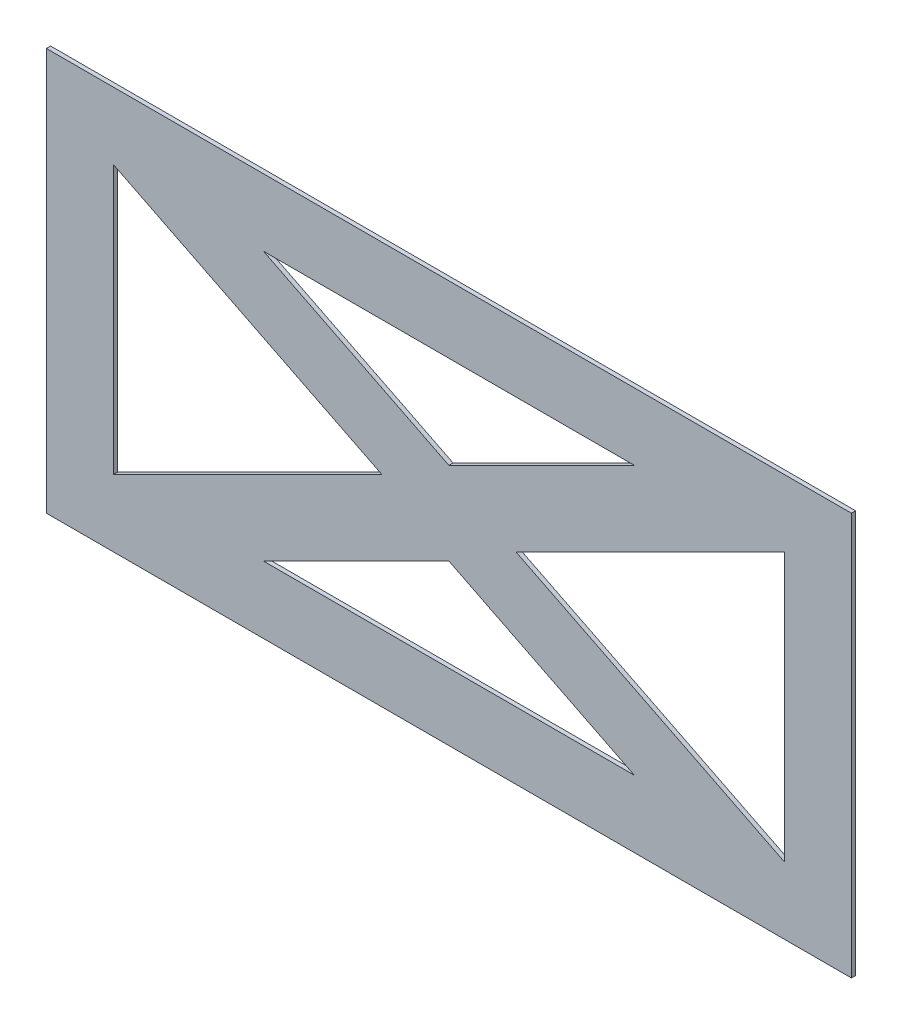
ISO-10303-21;
HEADER;
FILE_DESCRIPTION(('STEP AP214'),'2;1');
FILE_NAME('part.step','',(''),(''),'','','');
FILE_SCHEMA(('AUTOMOTIVE_DESIGN { 1 0 10303 214 1 1 1 1 }'));
ENDSEC;
DATA;
#1=APPLICATION_CONTEXT('core data for automotive mechanical design processes');
#2=APPLICATION_PROTOCOL_DEFINITION('international standard','automotive_design',2000,#1);
#3=PRODUCT_CONTEXT('',#1,'mechanical');
#4=PRODUCT('Part','Part','',(#3));
#5=PRODUCT_RELATED_PRODUCT_CATEGORY('part','',(#4));
#6=PRODUCT_DEFINITION_FORMATION('','',#4);
#7=PRODUCT_DEFINITION_CONTEXT('part definition',#1,'design');
#8=PRODUCT_DEFINITION('design','',#6,#7);
#9=PRODUCT_DEFINITION_SHAPE('','',#8);
#10=(LENGTH_UNIT() NAMED_UNIT(*) SI_UNIT(.MILLI.,.METRE.));
#11=(NAMED_UNIT(*) PLANE_ANGLE_UNIT() SI_UNIT($,.RADIAN.));
#12=(NAMED_UNIT(*) SI_UNIT($,.STERADIAN.) SOLID_ANGLE_UNIT());
#13=UNCERTAINTY_MEASURE_WITH_UNIT(LENGTH_MEASURE(1.E-05),#10,'distance_accuracy_value','');
#14=(GEOMETRIC_REPRESENTATION_CONTEXT(3) GLOBAL_UNCERTAINTY_ASSIGNED_CONTEXT((#13)) GLOBAL_UNIT_ASSIGNED_CONTEXT((#10,
#11,#12)) REPRESENTATION_CONTEXT('',''));
#15=CARTESIAN_POINT('',(0.,0.,0.));
#16=DIRECTION('',(0.,0.,1.));
#17=DIRECTION('',(1.,0.,0.));
#18=AXIS2_PLACEMENT_3D('',#15,#16,#17);
#19=CARTESIAN_POINT('',(0.,0.,0.79375));
#20=DIRECTION('',(0.,0.,-1.));
#21=DIRECTION('',(-1.,0.,0.));
#22=AXIS2_PLACEMENT_3D('',#19,#20,#21);
#23=PLANE('',#22);
#24=DIRECTION('',(-0.894427190999916,0.447213595499958,0.));
#25=VECTOR('',#24,1.);
#26=CARTESIAN_POINT('',(70.2038733715053,-50.8,0.79375));
#27=LINE('',#26,#25);
#28=CARTESIAN_POINT('',(70.2038733715053,-50.8,0.79375));
#29=VERTEX_POINT('',#28);
#30=CARTESIAN_POINT('',(0.,-15.6980633142473,0.79375));
#31=VERTEX_POINT('',#30);
#32=EDGE_CURVE('E183',#29,#31,#27,.T.);
#33=ORIENTED_EDGE('',*,*,#32,.F.);
#34=DIRECTION('',(1.,0.,0.));
#35=VECTOR('',#34,1.);
#36=CARTESIAN_POINT('',(-70.2038733715053,-50.8,0.79375));
#37=LINE('',#36,#35);
#38=CARTESIAN_POINT('',(-70.2038733715053,-50.8,0.79375));
#39=VERTEX_POINT('',#38);
#40=EDGE_CURVE('E189',#39,#29,#37,.T.);
#41=ORIENTED_EDGE('',*,*,#40,.F.);
#42=DIRECTION('',(-0.894427190999916,-0.447213595499958,0.));
#43=VECTOR('',#42,1.);
#44=CARTESIAN_POINT('',(0.,-15.6980633142473,0.79375));
#45=LINE('',#44,#43);
#46=EDGE_CURVE('E185',#31,#39,#45,.T.);
#47=ORIENTED_EDGE('',*,*,#46,.F.);
#48=EDGE_LOOP('',(#33,#41,#47));
#49=FACE_BOUND('',#48,.T.);
#50=DIRECTION('',(-0.894427190999916,0.447213595499958,0.));
#51=VECTOR('',#50,1.);
#52=CARTESIAN_POINT('',(-25.4,0.,0.79375));
#53=LINE('',#52,#51);
#54=CARTESIAN_POINT('',(-25.4,0.,0.79375));
#55=VERTEX_POINT('',#54);
#56=CARTESIAN_POINT('',(-127.,50.8,0.79375));
#57=VERTEX_POINT('',#56);
#58=EDGE_CURVE('E231',#55,#57,#53,.T.);
#59=ORIENTED_EDGE('',*,*,#58,.F.);
#60=DIRECTION('',(0.894427190999916,0.447213595499958,0.));
#61=VECTOR('',#60,1.);
#62=CARTESIAN_POINT('',(-127.,-50.8,0.79375));
#63=LINE('',#62,#61);
#64=CARTESIAN_POINT('',(-127.,-50.8,0.79375));
#65=VERTEX_POINT('',#64);
#66=EDGE_CURVE('E237',#65,#55,#63,.T.);
#67=ORIENTED_EDGE('',*,*,#66,.F.);
#68=DIRECTION('',(0.,-1.,0.));
#69=VECTOR('',#68,1.);
#70=CARTESIAN_POINT('',(-127.,50.8,0.79375));
#71=LINE('',#70,#69);
#72=EDGE_CURVE('E233',#57,#65,#71,.T.);
#73=ORIENTED_EDGE('',*,*,#72,.F.);
#74=EDGE_LOOP('',(#59,#67,#73));
#75=FACE_BOUND('',#74,.T.);
#76=DIRECTION('',(0.,1.,0.));
#77=VECTOR('',#76,1.);
#78=CARTESIAN_POINT('',(152.4,-76.2,0.79375));
#79=LINE('',#78,#77);
#80=CARTESIAN_POINT('',(152.4,-76.2,0.79375));
#81=VERTEX_POINT('',#80);
#82=CARTESIAN_POINT('',(152.4,76.2,0.79375));
#83=VERTEX_POINT('',#82);
#84=EDGE_CURVE('E255',#81,#83,#79,.T.);
#85=ORIENTED_EDGE('',*,*,#84,.T.);
#86=DIRECTION('',(-1.,0.,0.));
#87=VECTOR('',#86,1.);
#88=CARTESIAN_POINT('',(-152.4,76.2,0.79375));
#89=LINE('',#88,#87);
#90=CARTESIAN_POINT('',(-152.4,76.2,0.79375));
#91=VERTEX_POINT('',#90);
#92=EDGE_CURVE('E258',#83,#91,#89,.T.);
#93=ORIENTED_EDGE('',*,*,#92,.T.);
#94=DIRECTION('',(0.,-1.,0.));
#95=VECTOR('',#94,1.);
#96=CARTESIAN_POINT('',(-152.4,-76.2,0.79375));
#97=LINE('',#96,#95);
#98=CARTESIAN_POINT('',(-152.4,-76.2,0.79375));
#99=VERTEX_POINT('',#98);
#100=EDGE_CURVE('E261',#91,#99,#97,.T.);
#101=ORIENTED_EDGE('',*,*,#100,.T.);
#102=DIRECTION('',(1.,0.,0.));
#103=VECTOR('',#102,1.);
#104=CARTESIAN_POINT('',(-152.4,-76.2,0.79375));
#105=LINE('',#104,#103);
#106=EDGE_CURVE('E263',#99,#81,#105,.T.);
#107=ORIENTED_EDGE('',*,*,#106,.T.);
#108=EDGE_LOOP('',(#85,#93,#101,#107));
#109=FACE_BOUND('',#108,.T.);
#110=DIRECTION('',(0.894427190999916,-0.447213595499958,0.));
#111=VECTOR('',#110,1.);
#112=CARTESIAN_POINT('',(0.,15.6980633142473,0.79375));
#113=LINE('',#112,#111);
#114=CARTESIAN_POINT('',(-70.2038733715054,50.8,0.79375));
#115=VERTEX_POINT('',#114);
#116=CARTESIAN_POINT('',(0.,15.6980633142473,0.79375));
#117=VERTEX_POINT('',#116);
#118=EDGE_CURVE('E207',#115,#117,#113,.T.);
#119=ORIENTED_EDGE('',*,*,#118,.F.);
#120=DIRECTION('',(-1.,0.,0.));
#121=VECTOR('',#120,1.);
#122=CARTESIAN_POINT('',(-70.2038733715054,50.8,0.79375));
#123=LINE('',#122,#121);
#124=CARTESIAN_POINT('',(70.2038733715054,50.8,0.79375));
#125=VERTEX_POINT('',#124);
#126=EDGE_CURVE('E213',#125,#115,#123,.T.);
#127=ORIENTED_EDGE('',*,*,#126,.F.);
#128=DIRECTION('',(0.894427190999916,0.447213595499958,0.));
#129=VECTOR('',#128,1.);
#130=CARTESIAN_POINT('',(70.2038733715054,50.8,0.79375));
#131=LINE('',#130,#129);
#132=EDGE_CURVE('E209',#117,#125,#131,.T.);
#133=ORIENTED_EDGE('',*,*,#132,.F.);
#134=EDGE_LOOP('',(#119,#127,#133));
#135=FACE_BOUND('',#134,.T.);
#136=DIRECTION('',(0.894427190999916,-0.447213595499958,0.));
#137=VECTOR('',#136,1.);
#138=CARTESIAN_POINT('',(127.,-50.8,0.79375));
#139=LINE('',#138,#137);
#140=CARTESIAN_POINT('',(25.4,0.,0.79375));
#141=VERTEX_POINT('',#140);
#142=CARTESIAN_POINT('',(127.,-50.8,0.79375));
#143=VERTEX_POINT('',#142);
#144=EDGE_CURVE('E156',#141,#143,#139,.T.);
#145=ORIENTED_EDGE('',*,*,#144,.F.);
#146=DIRECTION('',(-0.894427190999916,-0.447213595499958,0.));
#147=VECTOR('',#146,1.);
#148=CARTESIAN_POINT('',(25.4,0.,0.79375));
#149=LINE('',#148,#147);
#150=CARTESIAN_POINT('',(127.,50.8,0.79375));
#151=VERTEX_POINT('',#150);
#152=EDGE_CURVE('E173',#151,#141,#149,.T.);
#153=ORIENTED_EDGE('',*,*,#152,.F.);
#154=DIRECTION('',(0.,1.,0.));
#155=VECTOR('',#154,1.);
#156=CARTESIAN_POINT('',(127.,50.8,0.79375));
#157=LINE('',#156,#155);
#158=EDGE_CURVE('E164',#143,#151,#157,.T.);
#159=ORIENTED_EDGE('',*,*,#158,.F.);
#160=EDGE_LOOP('',(#145,#153,#159));
#161=FACE_BOUND('',#160,.T.);
#162=ADVANCED_FACE('F43',(#49,#75,#109,#135,#161),#23,.F.);
#163=CARTESIAN_POINT('',(0.,0.,-0.79375));
#164=DIRECTION('',(0.,0.,-1.));
#165=DIRECTION('',(-1.,0.,0.));
#166=AXIS2_PLACEMENT_3D('',#163,#164,#165);
#167=PLANE('',#166);
#168=DIRECTION('',(0.,1.,0.));
#169=VECTOR('',#168,1.);
#170=CARTESIAN_POINT('',(152.4,-76.2,-0.79375));
#171=LINE('',#170,#169);
#172=CARTESIAN_POINT('',(152.4,-76.2,-0.79375));
#173=VERTEX_POINT('',#172);
#174=CARTESIAN_POINT('',(152.4,76.2,-0.79375));
#175=VERTEX_POINT('',#174);
#176=EDGE_CURVE('E254',#173,#175,#171,.T.);
#177=ORIENTED_EDGE('',*,*,#176,.F.);
#178=DIRECTION('',(1.,0.,0.));
#179=VECTOR('',#178,1.);
#180=CARTESIAN_POINT('',(-152.4,-76.2,-0.79375));
#181=LINE('',#180,#179);
#182=CARTESIAN_POINT('',(-152.4,-76.2,-0.79375));
#183=VERTEX_POINT('',#182);
#184=EDGE_CURVE('E259',#183,#173,#181,.T.);
#185=ORIENTED_EDGE('',*,*,#184,.F.);
#186=DIRECTION('',(0.,-1.,0.));
#187=VECTOR('',#186,1.);
#188=CARTESIAN_POINT('',(-152.4,-76.2,-0.79375));
#189=LINE('',#188,#187);
#190=CARTESIAN_POINT('',(-152.4,76.2,-0.79375));
#191=VERTEX_POINT('',#190);
#192=EDGE_CURVE('E270',#191,#183,#189,.T.);
#193=ORIENTED_EDGE('',*,*,#192,.F.);
#194=DIRECTION('',(-1.,0.,0.));
#195=VECTOR('',#194,1.);
#196=CARTESIAN_POINT('',(-152.4,76.2,-0.79375));
#197=LINE('',#196,#195);
#198=EDGE_CURVE('E268',#175,#191,#197,.T.);
#199=ORIENTED_EDGE('',*,*,#198,.F.);
#200=EDGE_LOOP('',(#177,#185,#193,#199));
#201=FACE_BOUND('',#200,.T.);
#202=DIRECTION('',(0.894427190999916,0.447213595499958,0.));
#203=VECTOR('',#202,1.);
#204=CARTESIAN_POINT('',(-127.,-50.8,-0.79375));
#205=LINE('',#204,#203);
#206=CARTESIAN_POINT('',(-127.,-50.8,-0.79375));
#207=VERTEX_POINT('',#206);
#208=CARTESIAN_POINT('',(-25.4,0.,-0.79375));
#209=VERTEX_POINT('',#208);
#210=EDGE_CURVE('E234',#207,#209,#205,.T.);
#211=ORIENTED_EDGE('',*,*,#210,.T.);
#212=DIRECTION('',(-0.894427190999916,0.447213595499958,0.));
#213=VECTOR('',#212,1.);
#214=CARTESIAN_POINT('',(-25.4,0.,-0.79375));
#215=LINE('',#214,#213);
#216=CARTESIAN_POINT('',(-127.,50.8,-0.79375));
#217=VERTEX_POINT('',#216);
#218=EDGE_CURVE('E230',#209,#217,#215,.T.);
#219=ORIENTED_EDGE('',*,*,#218,.T.);
#220=DIRECTION('',(0.,-1.,0.));
#221=VECTOR('',#220,1.);
#222=CARTESIAN_POINT('',(-127.,50.8,-0.79375));
#223=LINE('',#222,#221);
#224=EDGE_CURVE('E242',#217,#207,#223,.T.);
#225=ORIENTED_EDGE('',*,*,#224,.T.);
#226=EDGE_LOOP('',(#211,#219,#225));
#227=FACE_BOUND('',#226,.T.);
#228=DIRECTION('',(-1.,0.,0.));
#229=VECTOR('',#228,1.);
#230=CARTESIAN_POINT('',(-70.2038733715054,50.8,-0.79375));
#231=LINE('',#230,#229);
#232=CARTESIAN_POINT('',(70.2038733715054,50.8,-0.79375));
#233=VERTEX_POINT('',#232);
#234=CARTESIAN_POINT('',(-70.2038733715054,50.8,-0.79375));
#235=VERTEX_POINT('',#234);
#236=EDGE_CURVE('E210',#233,#235,#231,.T.);
#237=ORIENTED_EDGE('',*,*,#236,.T.);
#238=DIRECTION('',(0.894427190999916,-0.447213595499958,0.));
#239=VECTOR('',#238,1.);
#240=CARTESIAN_POINT('',(0.,15.6980633142473,-0.79375));
#241=LINE('',#240,#239);
#242=CARTESIAN_POINT('',(0.,15.6980633142473,-0.79375));
#243=VERTEX_POINT('',#242);
#244=EDGE_CURVE('E206',#235,#243,#241,.T.);
#245=ORIENTED_EDGE('',*,*,#244,.T.);
#246=DIRECTION('',(0.894427190999916,0.447213595499958,0.));
#247=VECTOR('',#246,1.);
#248=CARTESIAN_POINT('',(70.2038733715054,50.8,-0.79375));
#249=LINE('',#248,#247);
#250=EDGE_CURVE('E218',#243,#233,#249,.T.);
#251=ORIENTED_EDGE('',*,*,#250,.T.);
#252=EDGE_LOOP('',(#237,#245,#251));
#253=FACE_BOUND('',#252,.T.);
#254=DIRECTION('',(1.,0.,0.));
#255=VECTOR('',#254,1.);
#256=CARTESIAN_POINT('',(-70.2038733715053,-50.8,-0.79375));
#257=LINE('',#256,#255);
#258=CARTESIAN_POINT('',(-70.2038733715053,-50.8,-0.79375));
#259=VERTEX_POINT('',#258);
#260=CARTESIAN_POINT('',(70.2038733715053,-50.8,-0.79375));
#261=VERTEX_POINT('',#260);
#262=EDGE_CURVE('E186',#259,#261,#257,.T.);
#263=ORIENTED_EDGE('',*,*,#262,.T.);
#264=DIRECTION('',(-0.894427190999916,0.447213595499958,0.));
#265=VECTOR('',#264,1.);
#266=CARTESIAN_POINT('',(70.2038733715053,-50.8,-0.79375));
#267=LINE('',#266,#265);
#268=CARTESIAN_POINT('',(0.,-15.6980633142473,-0.79375));
#269=VERTEX_POINT('',#268);
#270=EDGE_CURVE('E171',#261,#269,#267,.T.);
#271=ORIENTED_EDGE('',*,*,#270,.T.);
#272=DIRECTION('',(-0.894427190999916,-0.447213595499958,0.));
#273=VECTOR('',#272,1.);
#274=CARTESIAN_POINT('',(0.,-15.6980633142473,-0.79375));
#275=LINE('',#274,#273);
#276=EDGE_CURVE('E194',#269,#259,#275,.T.);
#277=ORIENTED_EDGE('',*,*,#276,.T.);
#278=EDGE_LOOP('',(#263,#271,#277));
#279=FACE_BOUND('',#278,.T.);
#280=DIRECTION('',(-0.894427190999916,-0.447213595499958,0.));
#281=VECTOR('',#280,1.);
#282=CARTESIAN_POINT('',(25.4,0.,-0.79375));
#283=LINE('',#282,#281);
#284=CARTESIAN_POINT('',(127.,50.8,-0.79375));
#285=VERTEX_POINT('',#284);
#286=CARTESIAN_POINT('',(25.4,0.,-0.79375));
#287=VERTEX_POINT('',#286);
#288=EDGE_CURVE('E165',#285,#287,#283,.T.);
#289=ORIENTED_EDGE('',*,*,#288,.T.);
#290=DIRECTION('',(0.894427190999916,-0.447213595499958,0.));
#291=VECTOR('',#290,1.);
#292=CARTESIAN_POINT('',(127.,-50.8,-0.79375));
#293=LINE('',#292,#291);
#294=CARTESIAN_POINT('',(127.,-50.8,-0.79375));
#295=VERTEX_POINT('',#294);
#296=EDGE_CURVE('E66',#287,#295,#293,.T.);
#297=ORIENTED_EDGE('',*,*,#296,.T.);
#298=DIRECTION('',(0.,1.,0.));
#299=VECTOR('',#298,1.);
#300=CARTESIAN_POINT('',(127.,50.8,-0.79375));
#301=LINE('',#300,#299);
#302=EDGE_CURVE('E170',#295,#285,#301,.T.);
#303=ORIENTED_EDGE('',*,*,#302,.T.);
#304=EDGE_LOOP('',(#289,#297,#303));
#305=FACE_BOUND('',#304,.T.);
#306=ADVANCED_FACE('F288',(#201,#227,#253,#279,#305),#167,.T.);
#307=CARTESIAN_POINT('',(152.4,-76.2,0.79375));
#308=DIRECTION('',(-1.,0.,0.));
#309=DIRECTION('',(0.,0.,1.));
#310=AXIS2_PLACEMENT_3D('',#307,#308,#309);
#311=PLANE('',#310);
#312=ORIENTED_EDGE('',*,*,#176,.T.);
#313=DIRECTION('',(0.,0.,-1.));
#314=VECTOR('',#313,1.);
#315=CARTESIAN_POINT('',(152.4,76.2,0.79375));
#316=LINE('',#315,#314);
#317=EDGE_CURVE('E11',#83,#175,#316,.T.);
#318=ORIENTED_EDGE('',*,*,#317,.F.);
#319=ORIENTED_EDGE('',*,*,#84,.F.);
#320=DIRECTION('',(0.,0.,-1.));
#321=VECTOR('',#320,1.);
#322=CARTESIAN_POINT('',(152.4,-76.2,0.79375));
#323=LINE('',#322,#321);
#324=EDGE_CURVE('E265',#81,#173,#323,.T.);
#325=ORIENTED_EDGE('',*,*,#324,.T.);
#326=EDGE_LOOP('',(#312,#318,#319,#325));
#327=FACE_BOUND('',#326,.T.);
#328=ADVANCED_FACE('F45',(#327),#311,.F.);
#329=CARTESIAN_POINT('',(-152.4,76.2,0.79375));
#330=DIRECTION('',(0.,-1.,0.));
#331=DIRECTION('',(0.,0.,-1.));
#332=AXIS2_PLACEMENT_3D('',#329,#330,#331);
#333=PLANE('',#332);
#334=ORIENTED_EDGE('',*,*,#198,.T.);
#335=DIRECTION('',(0.,0.,-1.));
#336=VECTOR('',#335,1.);
#337=CARTESIAN_POINT('',(-152.4,76.2,0.79375));
#338=LINE('',#337,#336);
#339=EDGE_CURVE('E51',#91,#191,#338,.T.);
#340=ORIENTED_EDGE('',*,*,#339,.F.);
#341=ORIENTED_EDGE('',*,*,#92,.F.);
#342=ORIENTED_EDGE('',*,*,#317,.T.);
#343=EDGE_LOOP('',(#334,#340,#341,#342));
#344=FACE_BOUND('',#343,.T.);
#345=ADVANCED_FACE('F299',(#344),#333,.F.);
#346=CARTESIAN_POINT('',(-152.4,-76.2,0.79375));
#347=DIRECTION('',(1.,0.,0.));
#348=DIRECTION('',(0.,0.,-1.));
#349=AXIS2_PLACEMENT_3D('',#346,#347,#348);
#350=PLANE('',#349);
#351=ORIENTED_EDGE('',*,*,#192,.T.);
#352=DIRECTION('',(0.,0.,-1.));
#353=VECTOR('',#352,1.);
#354=CARTESIAN_POINT('',(-152.4,-76.2,0.79375));
#355=LINE('',#354,#353);
#356=EDGE_CURVE('E275',#99,#183,#355,.T.);
#357=ORIENTED_EDGE('',*,*,#356,.F.);
#358=ORIENTED_EDGE('',*,*,#100,.F.);
#359=ORIENTED_EDGE('',*,*,#339,.T.);
#360=EDGE_LOOP('',(#351,#357,#358,#359));
#361=FACE_BOUND('',#360,.T.);
#362=ADVANCED_FACE('F282',(#361),#350,.F.);
#363=CARTESIAN_POINT('',(-152.4,-76.2,0.79375));
#364=DIRECTION('',(0.,1.,0.));
#365=DIRECTION('',(0.,0.,1.));
#366=AXIS2_PLACEMENT_3D('',#363,#364,#365);
#367=PLANE('',#366);
#368=ORIENTED_EDGE('',*,*,#184,.T.);
#369=ORIENTED_EDGE('',*,*,#324,.F.);
#370=ORIENTED_EDGE('',*,*,#106,.F.);
#371=ORIENTED_EDGE('',*,*,#356,.T.);
#372=EDGE_LOOP('',(#368,#369,#370,#371));
#373=FACE_BOUND('',#372,.T.);
#374=ADVANCED_FACE('F292',(#373),#367,.F.);
#375=CARTESIAN_POINT('',(-25.4,0.,0.79375));
#376=DIRECTION('',(-0.447213595499958,-0.894427190999916,0.));
#377=DIRECTION('',(0.894427190999916,-0.447213595499958,0.));
#378=AXIS2_PLACEMENT_3D('',#375,#376,#377);
#379=PLANE('',#378);
#380=ORIENTED_EDGE('',*,*,#218,.F.);
#381=DIRECTION('',(0.,0.,-1.));
#382=VECTOR('',#381,1.);
#383=CARTESIAN_POINT('',(-25.4,0.,0.79375));
#384=LINE('',#383,#382);
#385=EDGE_CURVE('E239',#55,#209,#384,.T.);
#386=ORIENTED_EDGE('',*,*,#385,.F.);
#387=ORIENTED_EDGE('',*,*,#58,.T.);
#388=DIRECTION('',(0.,0.,-1.));
#389=VECTOR('',#388,1.);
#390=CARTESIAN_POINT('',(-127.,50.8,0.79375));
#391=LINE('',#390,#389);
#392=EDGE_CURVE('E251',#57,#217,#391,.T.);
#393=ORIENTED_EDGE('',*,*,#392,.T.);
#394=EDGE_LOOP('',(#380,#386,#387,#393));
#395=FACE_BOUND('',#394,.T.);
#396=ADVANCED_FACE('F316',(#395),#379,.T.);
#397=CARTESIAN_POINT('',(-127.,50.8,0.79375));
#398=DIRECTION('',(1.,0.,0.));
#399=DIRECTION('',(0.,0.,-1.));
#400=AXIS2_PLACEMENT_3D('',#397,#398,#399);
#401=PLANE('',#400);
#402=ORIENTED_EDGE('',*,*,#224,.F.);
#403=ORIENTED_EDGE('',*,*,#392,.F.);
#404=ORIENTED_EDGE('',*,*,#72,.T.);
#405=DIRECTION('',(0.,0.,-1.));
#406=VECTOR('',#405,1.);
#407=CARTESIAN_POINT('',(-127.,-50.8,0.79375));
#408=LINE('',#407,#406);
#409=EDGE_CURVE('E249',#65,#207,#408,.T.);
#410=ORIENTED_EDGE('',*,*,#409,.T.);
#411=EDGE_LOOP('',(#402,#403,#404,#410));
#412=FACE_BOUND('',#411,.T.);
#413=ADVANCED_FACE('F323',(#412),#401,.T.);
#414=CARTESIAN_POINT('',(-127.,-50.8,0.79375));
#415=DIRECTION('',(-0.447213595499958,0.894427190999916,0.));
#416=DIRECTION('',(-0.894427190999916,-0.447213595499958,0.));
#417=AXIS2_PLACEMENT_3D('',#414,#415,#416);
#418=PLANE('',#417);
#419=ORIENTED_EDGE('',*,*,#210,.F.);
#420=ORIENTED_EDGE('',*,*,#409,.F.);
#421=ORIENTED_EDGE('',*,*,#66,.T.);
#422=ORIENTED_EDGE('',*,*,#385,.T.);
#423=EDGE_LOOP('',(#419,#420,#421,#422));
#424=FACE_BOUND('',#423,.T.);
#425=ADVANCED_FACE('F328',(#424),#418,.T.);
#426=CARTESIAN_POINT('',(0.,15.6980633142473,0.79375));
#427=DIRECTION('',(0.447213595499958,0.894427190999916,0.));
#428=DIRECTION('',(-0.894427190999916,0.447213595499958,0.));
#429=AXIS2_PLACEMENT_3D('',#426,#427,#428);
#430=PLANE('',#429);
#431=ORIENTED_EDGE('',*,*,#244,.F.);
#432=DIRECTION('',(0.,0.,-1.));
#433=VECTOR('',#432,1.);
#434=CARTESIAN_POINT('',(-70.2038733715054,50.8,0.79375));
#435=LINE('',#434,#433);
#436=EDGE_CURVE('E215',#115,#235,#435,.T.);
#437=ORIENTED_EDGE('',*,*,#436,.F.);
#438=ORIENTED_EDGE('',*,*,#118,.T.);
#439=DIRECTION('',(0.,0.,-1.));
#440=VECTOR('',#439,1.);
#441=CARTESIAN_POINT('',(0.,15.6980633142473,0.79375));
#442=LINE('',#441,#440);
#443=EDGE_CURVE('E227',#117,#243,#442,.T.);
#444=ORIENTED_EDGE('',*,*,#443,.T.);
#445=EDGE_LOOP('',(#431,#437,#438,#444));
#446=FACE_BOUND('',#445,.T.);
#447=ADVANCED_FACE('F371',(#446),#430,.T.);
#448=CARTESIAN_POINT('',(70.2038733715054,50.8,0.79375));
#449=DIRECTION('',(-0.447213595499958,0.894427190999916,0.));
#450=DIRECTION('',(-0.894427190999916,-0.447213595499958,0.));
#451=AXIS2_PLACEMENT_3D('',#448,#449,#450);
#452=PLANE('',#451);
#453=ORIENTED_EDGE('',*,*,#250,.F.);
#454=ORIENTED_EDGE('',*,*,#443,.F.);
#455=ORIENTED_EDGE('',*,*,#132,.T.);
#456=DIRECTION('',(0.,0.,-1.));
#457=VECTOR('',#456,1.);
#458=CARTESIAN_POINT('',(70.2038733715054,50.8,0.79375));
#459=LINE('',#458,#457);
#460=EDGE_CURVE('E225',#125,#233,#459,.T.);
#461=ORIENTED_EDGE('',*,*,#460,.T.);
#462=EDGE_LOOP('',(#453,#454,#455,#461));
#463=FACE_BOUND('',#462,.T.);
#464=ADVANCED_FACE('F367',(#463),#452,.T.);
#465=CARTESIAN_POINT('',(-70.2038733715054,50.8,0.79375));
#466=DIRECTION('',(0.,-1.,0.));
#467=DIRECTION('',(0.,0.,-1.));
#468=AXIS2_PLACEMENT_3D('',#465,#466,#467);
#469=PLANE('',#468);
#470=ORIENTED_EDGE('',*,*,#236,.F.);
#471=ORIENTED_EDGE('',*,*,#460,.F.);
#472=ORIENTED_EDGE('',*,*,#126,.T.);
#473=ORIENTED_EDGE('',*,*,#436,.T.);
#474=EDGE_LOOP('',(#470,#471,#472,#473));
#475=FACE_BOUND('',#474,.T.);
#476=ADVANCED_FACE('F363',(#475),#469,.T.);
#477=CARTESIAN_POINT('',(70.2038733715053,-50.8,0.79375));
#478=DIRECTION('',(-0.447213595499958,-0.894427190999916,0.));
#479=DIRECTION('',(0.894427190999916,-0.447213595499958,0.));
#480=AXIS2_PLACEMENT_3D('',#477,#478,#479);
#481=PLANE('',#480);
#482=ORIENTED_EDGE('',*,*,#270,.F.);
#483=DIRECTION('',(0.,0.,-1.));
#484=VECTOR('',#483,1.);
#485=CARTESIAN_POINT('',(70.2038733715053,-50.8,0.79375));
#486=LINE('',#485,#484);
#487=EDGE_CURVE('E191',#29,#261,#486,.T.);
#488=ORIENTED_EDGE('',*,*,#487,.F.);
#489=ORIENTED_EDGE('',*,*,#32,.T.);
#490=DIRECTION('',(0.,0.,-1.));
#491=VECTOR('',#490,1.);
#492=CARTESIAN_POINT('',(0.,-15.6980633142473,0.79375));
#493=LINE('',#492,#491);
#494=EDGE_CURVE('E203',#31,#269,#493,.T.);
#495=ORIENTED_EDGE('',*,*,#494,.T.);
#496=EDGE_LOOP('',(#482,#488,#489,#495));
#497=FACE_BOUND('',#496,.T.);
#498=ADVANCED_FACE('F359',(#497),#481,.T.);
#499=CARTESIAN_POINT('',(0.,-15.6980633142473,0.79375));
#500=DIRECTION('',(0.447213595499958,-0.894427190999916,0.));
#501=DIRECTION('',(0.894427190999916,0.447213595499958,0.));
#502=AXIS2_PLACEMENT_3D('',#499,#500,#501);
#503=PLANE('',#502);
#504=ORIENTED_EDGE('',*,*,#276,.F.);
#505=ORIENTED_EDGE('',*,*,#494,.F.);
#506=ORIENTED_EDGE('',*,*,#46,.T.);
#507=DIRECTION('',(0.,0.,-1.));
#508=VECTOR('',#507,1.);
#509=CARTESIAN_POINT('',(-70.2038733715053,-50.8,0.79375));
#510=LINE('',#509,#508);
#511=EDGE_CURVE('E201',#39,#259,#510,.T.);
#512=ORIENTED_EDGE('',*,*,#511,.T.);
#513=EDGE_LOOP('',(#504,#505,#506,#512));
#514=FACE_BOUND('',#513,.T.);
#515=ADVANCED_FACE('F355',(#514),#503,.T.);
#516=CARTESIAN_POINT('',(-70.2038733715053,-50.8,0.79375));
#517=DIRECTION('',(0.,1.,0.));
#518=DIRECTION('',(-1.,0.,0.));
#519=AXIS2_PLACEMENT_3D('',#516,#517,#518);
#520=PLANE('',#519);
#521=ORIENTED_EDGE('',*,*,#262,.F.);
#522=ORIENTED_EDGE('',*,*,#511,.F.);
#523=ORIENTED_EDGE('',*,*,#40,.T.);
#524=ORIENTED_EDGE('',*,*,#487,.T.);
#525=EDGE_LOOP('',(#521,#522,#523,#524));
#526=FACE_BOUND('',#525,.T.);
#527=ADVANCED_FACE('F352',(#526),#520,.T.);
#528=CARTESIAN_POINT('',(127.,-50.8,0.79375));
#529=DIRECTION('',(0.447213595499958,0.894427190999916,0.));
#530=DIRECTION('',(-0.894427190999916,0.447213595499958,0.));
#531=AXIS2_PLACEMENT_3D('',#528,#529,#530);
#532=PLANE('',#531);
#533=ORIENTED_EDGE('',*,*,#296,.F.);
#534=DIRECTION('',(0.,0.,-1.));
#535=VECTOR('',#534,1.);
#536=CARTESIAN_POINT('',(25.4,0.,0.79375));
#537=LINE('',#536,#535);
#538=EDGE_CURVE('E160',#141,#287,#537,.T.);
#539=ORIENTED_EDGE('',*,*,#538,.F.);
#540=ORIENTED_EDGE('',*,*,#144,.T.);
#541=DIRECTION('',(0.,0.,-1.));
#542=VECTOR('',#541,1.);
#543=CARTESIAN_POINT('',(127.,-50.8,0.79375));
#544=LINE('',#543,#542);
#545=EDGE_CURVE('E159',#143,#295,#544,.T.);
#546=ORIENTED_EDGE('',*,*,#545,.T.);
#547=EDGE_LOOP('',(#533,#539,#540,#546));
#548=FACE_BOUND('',#547,.T.);
#549=ADVANCED_FACE('F158',(#548),#532,.T.);
#550=CARTESIAN_POINT('',(127.,50.8,0.79375));
#551=DIRECTION('',(-1.,0.,0.));
#552=DIRECTION('',(0.,0.,1.));
#553=AXIS2_PLACEMENT_3D('',#550,#551,#552);
#554=PLANE('',#553);
#555=ORIENTED_EDGE('',*,*,#302,.F.);
#556=ORIENTED_EDGE('',*,*,#545,.F.);
#557=ORIENTED_EDGE('',*,*,#158,.T.);
#558=DIRECTION('',(0.,0.,-1.));
#559=VECTOR('',#558,1.);
#560=CARTESIAN_POINT('',(127.,50.8,0.79375));
#561=LINE('',#560,#559);
#562=EDGE_CURVE('E58',#151,#285,#561,.T.);
#563=ORIENTED_EDGE('',*,*,#562,.T.);
#564=EDGE_LOOP('',(#555,#556,#557,#563));
#565=FACE_BOUND('',#564,.T.);
#566=ADVANCED_FACE('F168',(#565),#554,.T.);
#567=CARTESIAN_POINT('',(25.4,0.,0.79375));
#568=DIRECTION('',(0.447213595499958,-0.894427190999916,0.));
#569=DIRECTION('',(0.894427190999916,0.447213595499958,0.));
#570=AXIS2_PLACEMENT_3D('',#567,#568,#569);
#571=PLANE('',#570);
#572=ORIENTED_EDGE('',*,*,#288,.F.);
#573=ORIENTED_EDGE('',*,*,#562,.F.);
#574=ORIENTED_EDGE('',*,*,#152,.T.);
#575=ORIENTED_EDGE('',*,*,#538,.T.);
#576=EDGE_LOOP('',(#572,#573,#574,#575));
#577=FACE_BOUND('',#576,.T.);
#578=ADVANCED_FACE('F342',(#577),#571,.T.);
#579=CLOSED_SHELL('',(#162,#306,#328,#345,#362,#374,#396,#413,#425,#447,#464,#476,#498,#515,
#527,#549,#566,#578));
#580=MANIFOLD_SOLID_BREP('B2',#579);
#581=ADVANCED_BREP_SHAPE_REPRESENTATION('',(#18,#580),#14);
#582=SHAPE_DEFINITION_REPRESENTATION(#9,#581);
ENDSEC;
END-ISO-10303-21;
